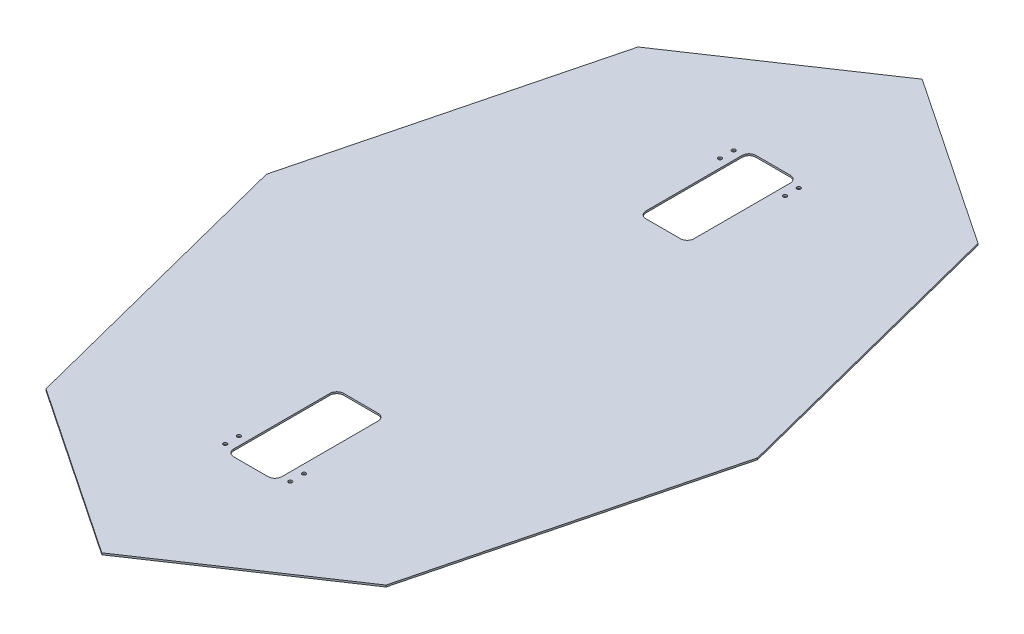
ISO-10303-21;
HEADER;
FILE_DESCRIPTION(('STEP AP214'),'2;1');
FILE_NAME('part.step','',(''),(''),'','','');
FILE_SCHEMA(('AUTOMOTIVE_DESIGN { 1 0 10303 214 1 1 1 1 }'));
ENDSEC;
DATA;
#1=APPLICATION_CONTEXT('core data for automotive mechanical design processes');
#2=APPLICATION_PROTOCOL_DEFINITION('international standard','automotive_design',2000,#1);
#3=PRODUCT_CONTEXT('',#1,'mechanical');
#4=PRODUCT('Part','Part','',(#3));
#5=PRODUCT_RELATED_PRODUCT_CATEGORY('part','',(#4));
#6=PRODUCT_DEFINITION_FORMATION('','',#4);
#7=PRODUCT_DEFINITION_CONTEXT('part definition',#1,'design');
#8=PRODUCT_DEFINITION('design','',#6,#7);
#9=PRODUCT_DEFINITION_SHAPE('','',#8);
#10=(LENGTH_UNIT() NAMED_UNIT(*) SI_UNIT(.MILLI.,.METRE.));
#11=(NAMED_UNIT(*) PLANE_ANGLE_UNIT() SI_UNIT($,.RADIAN.));
#12=(NAMED_UNIT(*) SI_UNIT($,.STERADIAN.) SOLID_ANGLE_UNIT());
#13=UNCERTAINTY_MEASURE_WITH_UNIT(LENGTH_MEASURE(1.E-05),#10,'distance_accuracy_value','');
#14=(GEOMETRIC_REPRESENTATION_CONTEXT(3) GLOBAL_UNCERTAINTY_ASSIGNED_CONTEXT((#13)) GLOBAL_UNIT_ASSIGNED_CONTEXT((#10,
#11,#12)) REPRESENTATION_CONTEXT('',''));
#15=CARTESIAN_POINT('',(0.,0.,0.));
#16=DIRECTION('',(0.,0.,1.));
#17=DIRECTION('',(1.,0.,0.));
#18=AXIS2_PLACEMENT_3D('',#15,#16,#17);
#19=CARTESIAN_POINT('',(0.,1.5875,0.));
#20=DIRECTION('',(0.,1.,0.));
#21=DIRECTION('',(0.,0.,1.));
#22=AXIS2_PLACEMENT_3D('',#19,#20,#21);
#23=PLANE('',#22);
#24=CARTESIAN_POINT('',(-60.1980000000001,1.5875,469.9));
#25=DIRECTION('',(0.,-1.,0.));
#26=DIRECTION('',(0.,0.,-1.));
#27=AXIS2_PLACEMENT_3D('',#24,#25,#26);
#28=CIRCLE('',#27,3.429);
#29=CARTESIAN_POINT('',(-60.1980000000001,1.5875,466.471));
#30=VERTEX_POINT('',#29);
#31=EDGE_CURVE('E617',#30,#30,#28,.T.);
#32=ORIENTED_EDGE('',*,*,#31,.T.);
#33=EDGE_LOOP('',(#32));
#34=FACE_BOUND('',#33,.T.);
#35=CARTESIAN_POINT('',(-60.1980000000001,1.5875,444.5));
#36=DIRECTION('',(0.,-1.,0.));
#37=DIRECTION('',(0.,0.,-1.));
#38=AXIS2_PLACEMENT_3D('',#35,#36,#37);
#39=CIRCLE('',#38,3.429);
#40=CARTESIAN_POINT('',(-60.1980000000001,1.5875,441.071));
#41=VERTEX_POINT('',#40);
#42=EDGE_CURVE('E611',#41,#41,#39,.T.);
#43=ORIENTED_EDGE('',*,*,#42,.T.);
#44=EDGE_LOOP('',(#43));
#45=FACE_BOUND('',#44,.T.);
#46=CARTESIAN_POINT('',(60.1979999999999,1.5875,444.5));
#47=DIRECTION('',(0.,1.,0.));
#48=DIRECTION('',(0.,0.,1.));
#49=AXIS2_PLACEMENT_3D('',#46,#47,#48);
#50=CIRCLE('',#49,3.42899999999999);
#51=CARTESIAN_POINT('',(60.1979999999999,1.5875,447.929));
#52=VERTEX_POINT('',#51);
#53=EDGE_CURVE('E614',#52,#52,#50,.T.);
#54=ORIENTED_EDGE('',*,*,#53,.F.);
#55=EDGE_LOOP('',(#54));
#56=FACE_BOUND('',#55,.T.);
#57=CARTESIAN_POINT('',(60.1979999999999,1.5875,469.9));
#58=DIRECTION('',(0.,1.,0.));
#59=DIRECTION('',(0.,0.,1.));
#60=AXIS2_PLACEMENT_3D('',#57,#58,#59);
#61=CIRCLE('',#60,3.42899999999999);
#62=CARTESIAN_POINT('',(60.1979999999999,1.5875,473.329));
#63=VERTEX_POINT('',#62);
#64=EDGE_CURVE('E626',#63,#63,#61,.T.);
#65=ORIENTED_EDGE('',*,*,#64,.F.);
#66=EDGE_LOOP('',(#65));
#67=FACE_BOUND('',#66,.T.);
#68=CARTESIAN_POINT('',(-60.1980000000001,1.5875,-469.9));
#69=DIRECTION('',(0.,1.,0.));
#70=DIRECTION('',(0.,0.,1.));
#71=AXIS2_PLACEMENT_3D('',#68,#69,#70);
#72=CIRCLE('',#71,3.429);
#73=CARTESIAN_POINT('',(-60.1980000000001,1.5875,-466.471));
#74=VERTEX_POINT('',#73);
#75=EDGE_CURVE('E405',#74,#74,#72,.T.);
#76=ORIENTED_EDGE('',*,*,#75,.F.);
#77=EDGE_LOOP('',(#76));
#78=FACE_BOUND('',#77,.T.);
#79=CARTESIAN_POINT('',(-60.1980000000001,1.5875,-444.5));
#80=DIRECTION('',(0.,1.,0.));
#81=DIRECTION('',(0.,0.,1.));
#82=AXIS2_PLACEMENT_3D('',#79,#80,#81);
#83=CIRCLE('',#82,3.429);
#84=CARTESIAN_POINT('',(-60.1980000000001,1.5875,-441.071));
#85=VERTEX_POINT('',#84);
#86=EDGE_CURVE('E411',#85,#85,#83,.T.);
#87=ORIENTED_EDGE('',*,*,#86,.F.);
#88=EDGE_LOOP('',(#87));
#89=FACE_BOUND('',#88,.T.);
#90=CARTESIAN_POINT('',(60.1979999999999,1.5875,-444.5));
#91=DIRECTION('',(0.,-1.,0.));
#92=DIRECTION('',(0.,0.,-1.));
#93=AXIS2_PLACEMENT_3D('',#90,#91,#92);
#94=CIRCLE('',#93,3.42899999999999);
#95=CARTESIAN_POINT('',(60.1979999999999,1.5875,-447.929));
#96=VERTEX_POINT('',#95);
#97=EDGE_CURVE('E417',#96,#96,#94,.T.);
#98=ORIENTED_EDGE('',*,*,#97,.T.);
#99=EDGE_LOOP('',(#98));
#100=FACE_BOUND('',#99,.T.);
#101=CARTESIAN_POINT('',(60.1979999999999,1.5875,-469.9));
#102=DIRECTION('',(0.,-1.,0.));
#103=DIRECTION('',(0.,0.,-1.));
#104=AXIS2_PLACEMENT_3D('',#101,#102,#103);
#105=CIRCLE('',#104,3.42899999999999);
#106=CARTESIAN_POINT('',(60.1979999999999,1.5875,-473.329));
#107=VERTEX_POINT('',#106);
#108=EDGE_CURVE('E423',#107,#107,#105,.T.);
#109=ORIENTED_EDGE('',*,*,#108,.T.);
#110=EDGE_LOOP('',(#109));
#111=FACE_BOUND('',#110,.T.);
#112=DIRECTION('',(1.,0.,0.));
#113=VECTOR('',#112,1.);
#114=CARTESIAN_POINT('',(-44.45,1.5875,-279.4));
#115=LINE('',#114,#113);
#116=CARTESIAN_POINT('',(-31.75,1.5875,-279.4));
#117=VERTEX_POINT('',#116);
#118=CARTESIAN_POINT('',(31.75,1.5875,-279.4));
#119=VERTEX_POINT('',#118);
#120=EDGE_CURVE('E426',#117,#119,#115,.T.);
#121=ORIENTED_EDGE('',*,*,#120,.F.);
#122=CARTESIAN_POINT('',(-31.75,1.5875,-292.1));
#123=DIRECTION('',(0.,1.,0.));
#124=DIRECTION('',(0.,0.,1.));
#125=AXIS2_PLACEMENT_3D('',#122,#123,#124);
#126=CIRCLE('',#125,12.7);
#127=CARTESIAN_POINT('',(-44.45,1.5875,-292.1));
#128=VERTEX_POINT('',#127);
#129=EDGE_CURVE('E245',#117,#128,#126,.F.);
#130=ORIENTED_EDGE('',*,*,#129,.T.);
#131=DIRECTION('',(0.,0.,-1.));
#132=VECTOR('',#131,1.);
#133=CARTESIAN_POINT('',(-44.45,1.5875,-279.4));
#134=LINE('',#133,#132);
#135=CARTESIAN_POINT('',(-44.45,1.5875,-469.9));
#136=VERTEX_POINT('',#135);
#137=EDGE_CURVE('E435',#128,#136,#134,.T.);
#138=ORIENTED_EDGE('',*,*,#137,.T.);
#139=CARTESIAN_POINT('',(-31.75,1.5875,-469.9));
#140=DIRECTION('',(0.,1.,0.));
#141=DIRECTION('',(0.,0.,1.));
#142=AXIS2_PLACEMENT_3D('',#139,#140,#141);
#143=CIRCLE('',#142,12.7);
#144=CARTESIAN_POINT('',(-31.75,1.5875,-482.6));
#145=VERTEX_POINT('',#144);
#146=EDGE_CURVE('E253',#136,#145,#143,.F.);
#147=ORIENTED_EDGE('',*,*,#146,.T.);
#148=DIRECTION('',(1.,0.,0.));
#149=VECTOR('',#148,1.);
#150=CARTESIAN_POINT('',(-44.45,1.5875,-482.6));
#151=LINE('',#150,#149);
#152=CARTESIAN_POINT('',(31.75,1.5875,-482.6));
#153=VERTEX_POINT('',#152);
#154=EDGE_CURVE('E432',#145,#153,#151,.T.);
#155=ORIENTED_EDGE('',*,*,#154,.T.);
#156=CARTESIAN_POINT('',(31.75,1.5875,-469.9));
#157=DIRECTION('',(0.,1.,0.));
#158=DIRECTION('',(0.,0.,1.));
#159=AXIS2_PLACEMENT_3D('',#156,#157,#158);
#160=CIRCLE('',#159,12.7);
#161=CARTESIAN_POINT('',(44.45,1.5875,-469.9));
#162=VERTEX_POINT('',#161);
#163=EDGE_CURVE('E257',#153,#162,#160,.F.);
#164=ORIENTED_EDGE('',*,*,#163,.T.);
#165=DIRECTION('',(0.,0.,-1.));
#166=VECTOR('',#165,1.);
#167=CARTESIAN_POINT('',(44.45,1.5875,-279.4));
#168=LINE('',#167,#166);
#169=CARTESIAN_POINT('',(44.45,1.5875,-292.1));
#170=VERTEX_POINT('',#169);
#171=EDGE_CURVE('E429',#170,#162,#168,.T.);
#172=ORIENTED_EDGE('',*,*,#171,.F.);
#173=CARTESIAN_POINT('',(31.75,1.5875,-292.1));
#174=DIRECTION('',(0.,1.,0.));
#175=DIRECTION('',(0.,0.,1.));
#176=AXIS2_PLACEMENT_3D('',#173,#174,#175);
#177=CIRCLE('',#176,12.7);
#178=EDGE_CURVE('E249',#170,#119,#177,.F.);
#179=ORIENTED_EDGE('',*,*,#178,.T.);
#180=EDGE_LOOP('',(#121,#130,#138,#147,#155,#164,#172,#179));
#181=FACE_BOUND('',#180,.T.);
#182=DIRECTION('',(-0.830136035999269,0.,0.557560904059297));
#183=VECTOR('',#182,1.);
#184=CARTESIAN_POINT('',(-314.234696616118,1.5875,-547.119578241946));
#185=LINE('',#184,#183);
#186=CARTESIAN_POINT('',(0.,1.5875,-758.175325654695));
#187=VERTEX_POINT('',#186);
#188=CARTESIAN_POINT('',(-314.234696616118,1.5875,-547.119578241946));
#189=VERTEX_POINT('',#188);
#190=EDGE_CURVE('E207',#187,#189,#185,.T.);
#191=ORIENTED_EDGE('',*,*,#190,.T.);
#192=DIRECTION('',(-0.247380499716694,0.,0.968918411611586));
#193=VECTOR('',#192,1.);
#194=CARTESIAN_POINT('',(-314.234696616118,1.5875,-547.119578241946));
#195=LINE('',#194,#193);
#196=CARTESIAN_POINT('',(-453.92315030662,1.5875,0.));
#197=VERTEX_POINT('',#196);
#198=EDGE_CURVE('E196',#189,#197,#195,.T.);
#199=ORIENTED_EDGE('',*,*,#198,.T.);
#200=DIRECTION('',(0.247380499716694,0.,0.968918411611586));
#201=VECTOR('',#200,1.);
#202=CARTESIAN_POINT('',(-314.234696616118,1.5875,547.119578241946));
#203=LINE('',#202,#201);
#204=CARTESIAN_POINT('',(-314.234696616118,1.5875,547.119578241946));
#205=VERTEX_POINT('',#204);
#206=EDGE_CURVE('E206',#197,#205,#203,.T.);
#207=ORIENTED_EDGE('',*,*,#206,.T.);
#208=DIRECTION('',(0.830136035999269,0.,0.557560904059297));
#209=VECTOR('',#208,1.);
#210=CARTESIAN_POINT('',(1.11022302462516E-13,1.5875,758.175325654695));
#211=LINE('',#210,#209);
#212=CARTESIAN_POINT('',(1.11022302462516E-13,1.5875,758.175325654695));
#213=VERTEX_POINT('',#212);
#214=EDGE_CURVE('E451',#205,#213,#211,.T.);
#215=ORIENTED_EDGE('',*,*,#214,.T.);
#216=DIRECTION('',(0.830136035999269,0.,-0.557560904059297));
#217=VECTOR('',#216,1.);
#218=CARTESIAN_POINT('',(314.234696616118,1.5875,547.119578241947));
#219=LINE('',#218,#217);
#220=CARTESIAN_POINT('',(314.234696616118,1.5875,547.119578241947));
#221=VERTEX_POINT('',#220);
#222=EDGE_CURVE('E453',#213,#221,#219,.T.);
#223=ORIENTED_EDGE('',*,*,#222,.T.);
#224=DIRECTION('',(0.247380499716694,0.,-0.968918411611586));
#225=VECTOR('',#224,1.);
#226=CARTESIAN_POINT('',(314.234696616118,1.5875,547.119578241947));
#227=LINE('',#226,#225);
#228=CARTESIAN_POINT('',(453.92315030662,1.5875,0.));
#229=VERTEX_POINT('',#228);
#230=EDGE_CURVE('E455',#221,#229,#227,.T.);
#231=ORIENTED_EDGE('',*,*,#230,.T.);
#232=DIRECTION('',(-0.247380499716694,0.,-0.968918411611586));
#233=VECTOR('',#232,1.);
#234=CARTESIAN_POINT('',(453.92315030662,1.5875,0.));
#235=LINE('',#234,#233);
#236=CARTESIAN_POINT('',(314.234696616118,1.5875,-547.119578241946));
#237=VERTEX_POINT('',#236);
#238=EDGE_CURVE('E457',#229,#237,#235,.T.);
#239=ORIENTED_EDGE('',*,*,#238,.T.);
#240=DIRECTION('',(-0.830136035999269,0.,-0.557560904059297));
#241=VECTOR('',#240,1.);
#242=CARTESIAN_POINT('',(314.234696616118,1.5875,-547.119578241946));
#243=LINE('',#242,#241);
#244=EDGE_CURVE('E211',#237,#187,#243,.T.);
#245=ORIENTED_EDGE('',*,*,#244,.T.);
#246=EDGE_LOOP('',(#191,#199,#207,#215,#223,#231,#239,#245));
#247=FACE_BOUND('',#246,.T.);
#248=DIRECTION('',(0.,0.,1.));
#249=VECTOR('',#248,1.);
#250=CARTESIAN_POINT('',(-44.45,1.5875,279.4));
#251=LINE('',#250,#249);
#252=CARTESIAN_POINT('',(-44.45,1.5875,292.1));
#253=VERTEX_POINT('',#252);
#254=CARTESIAN_POINT('',(-44.45,1.5875,469.9));
#255=VERTEX_POINT('',#254);
#256=EDGE_CURVE('E635',#253,#255,#251,.T.);
#257=ORIENTED_EDGE('',*,*,#256,.F.);
#258=CARTESIAN_POINT('',(-31.75,1.5875,292.1));
#259=DIRECTION('',(0.,1.,0.));
#260=DIRECTION('',(0.,0.,1.));
#261=AXIS2_PLACEMENT_3D('',#258,#259,#260);
#262=CIRCLE('',#261,12.7);
#263=CARTESIAN_POINT('',(-31.75,1.5875,279.4));
#264=VERTEX_POINT('',#263);
#265=EDGE_CURVE('E280',#253,#264,#262,.F.);
#266=ORIENTED_EDGE('',*,*,#265,.T.);
#267=DIRECTION('',(1.,0.,0.));
#268=VECTOR('',#267,1.);
#269=CARTESIAN_POINT('',(-44.45,1.5875,279.4));
#270=LINE('',#269,#268);
#271=CARTESIAN_POINT('',(31.75,1.5875,279.4));
#272=VERTEX_POINT('',#271);
#273=EDGE_CURVE('E632',#264,#272,#270,.T.);
#274=ORIENTED_EDGE('',*,*,#273,.T.);
#275=CARTESIAN_POINT('',(31.75,1.5875,292.1));
#276=DIRECTION('',(0.,1.,0.));
#277=DIRECTION('',(0.,0.,1.));
#278=AXIS2_PLACEMENT_3D('',#275,#276,#277);
#279=CIRCLE('',#278,12.7);
#280=CARTESIAN_POINT('',(44.45,1.5875,292.1));
#281=VERTEX_POINT('',#280);
#282=EDGE_CURVE('E284',#272,#281,#279,.F.);
#283=ORIENTED_EDGE('',*,*,#282,.T.);
#284=DIRECTION('',(0.,0.,1.));
#285=VECTOR('',#284,1.);
#286=CARTESIAN_POINT('',(44.45,1.5875,279.4));
#287=LINE('',#286,#285);
#288=CARTESIAN_POINT('',(44.45,1.5875,469.9));
#289=VERTEX_POINT('',#288);
#290=EDGE_CURVE('E396',#281,#289,#287,.T.);
#291=ORIENTED_EDGE('',*,*,#290,.T.);
#292=CARTESIAN_POINT('',(31.75,1.5875,469.9));
#293=DIRECTION('',(0.,1.,0.));
#294=DIRECTION('',(0.,0.,1.));
#295=AXIS2_PLACEMENT_3D('',#292,#293,#294);
#296=CIRCLE('',#295,12.7);
#297=CARTESIAN_POINT('',(31.75,1.5875,482.6));
#298=VERTEX_POINT('',#297);
#299=EDGE_CURVE('E43',#289,#298,#296,.F.);
#300=ORIENTED_EDGE('',*,*,#299,.T.);
#301=DIRECTION('',(1.,0.,0.));
#302=VECTOR('',#301,1.);
#303=CARTESIAN_POINT('',(-44.45,1.5875,482.6));
#304=LINE('',#303,#302);
#305=CARTESIAN_POINT('',(-31.75,1.5875,482.6));
#306=VERTEX_POINT('',#305);
#307=EDGE_CURVE('E637',#306,#298,#304,.T.);
#308=ORIENTED_EDGE('',*,*,#307,.F.);
#309=CARTESIAN_POINT('',(-31.75,1.5875,469.9));
#310=DIRECTION('',(0.,1.,0.));
#311=DIRECTION('',(0.,0.,1.));
#312=AXIS2_PLACEMENT_3D('',#309,#310,#311);
#313=CIRCLE('',#312,12.7);
#314=EDGE_CURVE('E57',#306,#255,#313,.F.);
#315=ORIENTED_EDGE('',*,*,#314,.T.);
#316=EDGE_LOOP('',(#257,#266,#274,#283,#291,#300,#308,#315));
#317=FACE_BOUND('',#316,.T.);
#318=ADVANCED_FACE('F35',(#34,#45,#56,#67,#78,#89,#100,#111,#181,#247,#317),#23,.T.);
#319=CARTESIAN_POINT('',(0.,-1.5875,0.));
#320=DIRECTION('',(0.,1.,0.));
#321=DIRECTION('',(0.,0.,1.));
#322=AXIS2_PLACEMENT_3D('',#319,#320,#321);
#323=PLANE('',#322);
#324=CARTESIAN_POINT('',(-60.1980000000001,-1.5875,469.9));
#325=DIRECTION('',(0.,-1.,0.));
#326=DIRECTION('',(0.,0.,-1.));
#327=AXIS2_PLACEMENT_3D('',#324,#325,#326);
#328=CIRCLE('',#327,3.429);
#329=CARTESIAN_POINT('',(-60.1980000000001,-1.5875,466.471));
#330=VERTEX_POINT('',#329);
#331=EDGE_CURVE('E612',#330,#330,#328,.T.);
#332=ORIENTED_EDGE('',*,*,#331,.F.);
#333=EDGE_LOOP('',(#332));
#334=FACE_BOUND('',#333,.T.);
#335=CARTESIAN_POINT('',(-60.1980000000001,-1.5875,444.5));
#336=DIRECTION('',(0.,-1.,0.));
#337=DIRECTION('',(0.,0.,-1.));
#338=AXIS2_PLACEMENT_3D('',#335,#336,#337);
#339=CIRCLE('',#338,3.429);
#340=CARTESIAN_POINT('',(-60.1980000000001,-1.5875,441.071));
#341=VERTEX_POINT('',#340);
#342=EDGE_CURVE('E608',#341,#341,#339,.T.);
#343=ORIENTED_EDGE('',*,*,#342,.F.);
#344=EDGE_LOOP('',(#343));
#345=FACE_BOUND('',#344,.T.);
#346=CARTESIAN_POINT('',(60.1979999999999,-1.5875,444.5));
#347=DIRECTION('',(0.,1.,0.));
#348=DIRECTION('',(0.,0.,1.));
#349=AXIS2_PLACEMENT_3D('',#346,#347,#348);
#350=CIRCLE('',#349,3.42899999999999);
#351=CARTESIAN_POINT('',(60.1979999999999,-1.5875,447.929));
#352=VERTEX_POINT('',#351);
#353=EDGE_CURVE('E623',#352,#352,#350,.T.);
#354=ORIENTED_EDGE('',*,*,#353,.T.);
#355=EDGE_LOOP('',(#354));
#356=FACE_BOUND('',#355,.T.);
#357=CARTESIAN_POINT('',(60.1979999999999,-1.5875,469.9));
#358=DIRECTION('',(0.,1.,0.));
#359=DIRECTION('',(0.,0.,1.));
#360=AXIS2_PLACEMENT_3D('',#357,#358,#359);
#361=CIRCLE('',#360,3.42899999999999);
#362=CARTESIAN_POINT('',(60.1979999999999,-1.5875,473.329));
#363=VERTEX_POINT('',#362);
#364=EDGE_CURVE('E629',#363,#363,#361,.T.);
#365=ORIENTED_EDGE('',*,*,#364,.T.);
#366=EDGE_LOOP('',(#365));
#367=FACE_BOUND('',#366,.T.);
#368=DIRECTION('',(-0.830136035999269,0.,0.557560904059297));
#369=VECTOR('',#368,1.);
#370=CARTESIAN_POINT('',(-314.234696616118,-1.5875,-547.119578241946));
#371=LINE('',#370,#369);
#372=CARTESIAN_POINT('',(0.,-1.5875,-758.175325654695));
#373=VERTEX_POINT('',#372);
#374=CARTESIAN_POINT('',(-314.234696616118,-1.5875,-547.119578241946));
#375=VERTEX_POINT('',#374);
#376=EDGE_CURVE('E219',#373,#375,#371,.T.);
#377=ORIENTED_EDGE('',*,*,#376,.F.);
#378=DIRECTION('',(-0.830136035999269,0.,-0.557560904059297));
#379=VECTOR('',#378,1.);
#380=CARTESIAN_POINT('',(314.234696616118,-1.5875,-547.119578241946));
#381=LINE('',#380,#379);
#382=CARTESIAN_POINT('',(314.234696616118,-1.5875,-547.119578241946));
#383=VERTEX_POINT('',#382);
#384=EDGE_CURVE('E215',#383,#373,#381,.T.);
#385=ORIENTED_EDGE('',*,*,#384,.F.);
#386=DIRECTION('',(-0.247380499716694,0.,-0.968918411611586));
#387=VECTOR('',#386,1.);
#388=CARTESIAN_POINT('',(453.92315030662,-1.5875,0.));
#389=LINE('',#388,#387);
#390=CARTESIAN_POINT('',(453.92315030662,-1.5875,0.));
#391=VERTEX_POINT('',#390);
#392=EDGE_CURVE('E472',#391,#383,#389,.T.);
#393=ORIENTED_EDGE('',*,*,#392,.F.);
#394=DIRECTION('',(0.247380499716694,0.,-0.968918411611586));
#395=VECTOR('',#394,1.);
#396=CARTESIAN_POINT('',(314.234696616118,-1.5875,547.119578241947));
#397=LINE('',#396,#395);
#398=CARTESIAN_POINT('',(314.234696616118,-1.5875,547.119578241947));
#399=VERTEX_POINT('',#398);
#400=EDGE_CURVE('E470',#399,#391,#397,.T.);
#401=ORIENTED_EDGE('',*,*,#400,.F.);
#402=DIRECTION('',(0.830136035999269,0.,-0.557560904059297));
#403=VECTOR('',#402,1.);
#404=CARTESIAN_POINT('',(314.234696616118,-1.5875,547.119578241947));
#405=LINE('',#404,#403);
#406=CARTESIAN_POINT('',(1.11022302462516E-13,-1.5875,758.175325654695));
#407=VERTEX_POINT('',#406);
#408=EDGE_CURVE('E468',#407,#399,#405,.T.);
#409=ORIENTED_EDGE('',*,*,#408,.F.);
#410=DIRECTION('',(0.830136035999269,0.,0.557560904059297));
#411=VECTOR('',#410,1.);
#412=CARTESIAN_POINT('',(1.11022302462516E-13,-1.5875,758.175325654695));
#413=LINE('',#412,#411);
#414=CARTESIAN_POINT('',(-314.234696616118,-1.5875,547.119578241946));
#415=VERTEX_POINT('',#414);
#416=EDGE_CURVE('E466',#415,#407,#413,.T.);
#417=ORIENTED_EDGE('',*,*,#416,.F.);
#418=DIRECTION('',(0.247380499716694,0.,0.968918411611586));
#419=VECTOR('',#418,1.);
#420=CARTESIAN_POINT('',(-314.234696616118,-1.5875,547.119578241946));
#421=LINE('',#420,#419);
#422=CARTESIAN_POINT('',(-453.92315030662,-1.5875,0.));
#423=VERTEX_POINT('',#422);
#424=EDGE_CURVE('E464',#423,#415,#421,.T.);
#425=ORIENTED_EDGE('',*,*,#424,.F.);
#426=DIRECTION('',(-0.247380499716694,0.,0.968918411611586));
#427=VECTOR('',#426,1.);
#428=CARTESIAN_POINT('',(-314.234696616118,-1.5875,-547.119578241946));
#429=LINE('',#428,#427);
#430=EDGE_CURVE('E462',#375,#423,#429,.T.);
#431=ORIENTED_EDGE('',*,*,#430,.F.);
#432=EDGE_LOOP('',(#377,#385,#393,#401,#409,#417,#425,#431));
#433=FACE_BOUND('',#432,.T.);
#434=DIRECTION('',(0.,0.,-1.));
#435=VECTOR('',#434,1.);
#436=CARTESIAN_POINT('',(-44.45,-1.5875,-279.4));
#437=LINE('',#436,#435);
#438=CARTESIAN_POINT('',(-44.45,-1.5875,-292.1));
#439=VERTEX_POINT('',#438);
#440=CARTESIAN_POINT('',(-44.45,-1.5875,-469.9));
#441=VERTEX_POINT('',#440);
#442=EDGE_CURVE('E447',#439,#441,#437,.T.);
#443=ORIENTED_EDGE('',*,*,#442,.F.);
#444=CARTESIAN_POINT('',(-31.75,-1.5875,-292.1));
#445=DIRECTION('',(0.,1.,0.));
#446=DIRECTION('',(0.,0.,1.));
#447=AXIS2_PLACEMENT_3D('',#444,#445,#446);
#448=CIRCLE('',#447,12.7);
#449=CARTESIAN_POINT('',(-31.75,-1.5875,-279.4));
#450=VERTEX_POINT('',#449);
#451=EDGE_CURVE('E247',#439,#450,#448,.T.);
#452=ORIENTED_EDGE('',*,*,#451,.T.);
#453=DIRECTION('',(1.,0.,0.));
#454=VECTOR('',#453,1.);
#455=CARTESIAN_POINT('',(-44.45,-1.5875,-279.4));
#456=LINE('',#455,#454);
#457=CARTESIAN_POINT('',(31.75,-1.5875,-279.4));
#458=VERTEX_POINT('',#457);
#459=EDGE_CURVE('E438',#450,#458,#456,.T.);
#460=ORIENTED_EDGE('',*,*,#459,.T.);
#461=CARTESIAN_POINT('',(31.75,-1.5875,-292.1));
#462=DIRECTION('',(0.,1.,0.));
#463=DIRECTION('',(0.,0.,1.));
#464=AXIS2_PLACEMENT_3D('',#461,#462,#463);
#465=CIRCLE('',#464,12.7);
#466=CARTESIAN_POINT('',(44.45,-1.5875,-292.1));
#467=VERTEX_POINT('',#466);
#468=EDGE_CURVE('E251',#458,#467,#465,.T.);
#469=ORIENTED_EDGE('',*,*,#468,.T.);
#470=DIRECTION('',(0.,0.,-1.));
#471=VECTOR('',#470,1.);
#472=CARTESIAN_POINT('',(44.45,-1.5875,-279.4));
#473=LINE('',#472,#471);
#474=CARTESIAN_POINT('',(44.45,-1.5875,-469.9));
#475=VERTEX_POINT('',#474);
#476=EDGE_CURVE('E441',#467,#475,#473,.T.);
#477=ORIENTED_EDGE('',*,*,#476,.T.);
#478=CARTESIAN_POINT('',(31.75,-1.5875,-469.9));
#479=DIRECTION('',(0.,1.,0.));
#480=DIRECTION('',(0.,0.,1.));
#481=AXIS2_PLACEMENT_3D('',#478,#479,#480);
#482=CIRCLE('',#481,12.7);
#483=CARTESIAN_POINT('',(31.75,-1.5875,-482.6));
#484=VERTEX_POINT('',#483);
#485=EDGE_CURVE('E259',#475,#484,#482,.T.);
#486=ORIENTED_EDGE('',*,*,#485,.T.);
#487=DIRECTION('',(1.,0.,0.));
#488=VECTOR('',#487,1.);
#489=CARTESIAN_POINT('',(-44.45,-1.5875,-482.6));
#490=LINE('',#489,#488);
#491=CARTESIAN_POINT('',(-31.75,-1.5875,-482.6));
#492=VERTEX_POINT('',#491);
#493=EDGE_CURVE('E444',#492,#484,#490,.T.);
#494=ORIENTED_EDGE('',*,*,#493,.F.);
#495=CARTESIAN_POINT('',(-31.75,-1.5875,-469.9));
#496=DIRECTION('',(0.,1.,0.));
#497=DIRECTION('',(0.,0.,1.));
#498=AXIS2_PLACEMENT_3D('',#495,#496,#497);
#499=CIRCLE('',#498,12.7);
#500=EDGE_CURVE('E255',#492,#441,#499,.T.);
#501=ORIENTED_EDGE('',*,*,#500,.T.);
#502=EDGE_LOOP('',(#443,#452,#460,#469,#477,#486,#494,#501));
#503=FACE_BOUND('',#502,.T.);
#504=CARTESIAN_POINT('',(60.1979999999999,-1.5875,-469.9));
#505=DIRECTION('',(0.,-1.,0.));
#506=DIRECTION('',(0.,0.,-1.));
#507=AXIS2_PLACEMENT_3D('',#504,#505,#506);
#508=CIRCLE('',#507,3.42899999999999);
#509=CARTESIAN_POINT('',(60.1979999999999,-1.5875,-473.329));
#510=VERTEX_POINT('',#509);
#511=EDGE_CURVE('E420',#510,#510,#508,.T.);
#512=ORIENTED_EDGE('',*,*,#511,.F.);
#513=EDGE_LOOP('',(#512));
#514=FACE_BOUND('',#513,.T.);
#515=CARTESIAN_POINT('',(60.1979999999999,-1.5875,-444.5));
#516=DIRECTION('',(0.,-1.,0.));
#517=DIRECTION('',(0.,0.,-1.));
#518=AXIS2_PLACEMENT_3D('',#515,#516,#517);
#519=CIRCLE('',#518,3.42899999999999);
#520=CARTESIAN_POINT('',(60.1979999999999,-1.5875,-447.929));
#521=VERTEX_POINT('',#520);
#522=EDGE_CURVE('E414',#521,#521,#519,.T.);
#523=ORIENTED_EDGE('',*,*,#522,.F.);
#524=EDGE_LOOP('',(#523));
#525=FACE_BOUND('',#524,.T.);
#526=CARTESIAN_POINT('',(-60.1980000000001,-1.5875,-444.5));
#527=DIRECTION('',(0.,1.,0.));
#528=DIRECTION('',(0.,0.,1.));
#529=AXIS2_PLACEMENT_3D('',#526,#527,#528);
#530=CIRCLE('',#529,3.429);
#531=CARTESIAN_POINT('',(-60.1980000000001,-1.5875,-441.071));
#532=VERTEX_POINT('',#531);
#533=EDGE_CURVE('E408',#532,#532,#530,.T.);
#534=ORIENTED_EDGE('',*,*,#533,.T.);
#535=EDGE_LOOP('',(#534));
#536=FACE_BOUND('',#535,.T.);
#537=CARTESIAN_POINT('',(-60.1980000000001,-1.5875,-469.9));
#538=DIRECTION('',(0.,1.,0.));
#539=DIRECTION('',(0.,0.,1.));
#540=AXIS2_PLACEMENT_3D('',#537,#538,#539);
#541=CIRCLE('',#540,3.429);
#542=CARTESIAN_POINT('',(-60.1980000000001,-1.5875,-466.471));
#543=VERTEX_POINT('',#542);
#544=EDGE_CURVE('E402',#543,#543,#541,.T.);
#545=ORIENTED_EDGE('',*,*,#544,.T.);
#546=EDGE_LOOP('',(#545));
#547=FACE_BOUND('',#546,.T.);
#548=DIRECTION('',(1.,0.,0.));
#549=VECTOR('',#548,1.);
#550=CARTESIAN_POINT('',(-44.45,-1.5875,279.4));
#551=LINE('',#550,#549);
#552=CARTESIAN_POINT('',(-31.75,-1.5875,279.4));
#553=VERTEX_POINT('',#552);
#554=CARTESIAN_POINT('',(31.75,-1.5875,279.4));
#555=VERTEX_POINT('',#554);
#556=EDGE_CURVE('E390',#553,#555,#551,.T.);
#557=ORIENTED_EDGE('',*,*,#556,.F.);
#558=CARTESIAN_POINT('',(-31.75,-1.5875,292.1));
#559=DIRECTION('',(0.,1.,0.));
#560=DIRECTION('',(0.,0.,1.));
#561=AXIS2_PLACEMENT_3D('',#558,#559,#560);
#562=CIRCLE('',#561,12.7);
#563=CARTESIAN_POINT('',(-44.45,-1.5875,292.1));
#564=VERTEX_POINT('',#563);
#565=EDGE_CURVE('E282',#553,#564,#562,.T.);
#566=ORIENTED_EDGE('',*,*,#565,.T.);
#567=DIRECTION('',(0.,0.,1.));
#568=VECTOR('',#567,1.);
#569=CARTESIAN_POINT('',(-44.45,-1.5875,279.4));
#570=LINE('',#569,#568);
#571=CARTESIAN_POINT('',(-44.45,-1.5875,469.9));
#572=VERTEX_POINT('',#571);
#573=EDGE_CURVE('E300',#564,#572,#570,.T.);
#574=ORIENTED_EDGE('',*,*,#573,.T.);
#575=CARTESIAN_POINT('',(-31.75,-1.5875,469.9));
#576=DIRECTION('',(0.,1.,0.));
#577=DIRECTION('',(0.,0.,1.));
#578=AXIS2_PLACEMENT_3D('',#575,#576,#577);
#579=CIRCLE('',#578,12.7);
#580=CARTESIAN_POINT('',(-31.75,-1.5875,482.6));
#581=VERTEX_POINT('',#580);
#582=EDGE_CURVE('E289',#572,#581,#579,.T.);
#583=ORIENTED_EDGE('',*,*,#582,.T.);
#584=DIRECTION('',(1.,0.,0.));
#585=VECTOR('',#584,1.);
#586=CARTESIAN_POINT('',(-44.45,-1.5875,482.6));
#587=LINE('',#586,#585);
#588=CARTESIAN_POINT('',(31.75,-1.5875,482.6));
#589=VERTEX_POINT('',#588);
#590=EDGE_CURVE('E297',#581,#589,#587,.T.);
#591=ORIENTED_EDGE('',*,*,#590,.T.);
#592=CARTESIAN_POINT('',(31.75,-1.5875,469.9));
#593=DIRECTION('',(0.,1.,0.));
#594=DIRECTION('',(0.,0.,1.));
#595=AXIS2_PLACEMENT_3D('',#592,#593,#594);
#596=CIRCLE('',#595,12.7);
#597=CARTESIAN_POINT('',(44.45,-1.5875,469.9));
#598=VERTEX_POINT('',#597);
#599=EDGE_CURVE('E11',#589,#598,#596,.T.);
#600=ORIENTED_EDGE('',*,*,#599,.T.);
#601=DIRECTION('',(0.,0.,1.));
#602=VECTOR('',#601,1.);
#603=CARTESIAN_POINT('',(44.45,-1.5875,279.4));
#604=LINE('',#603,#602);
#605=CARTESIAN_POINT('',(44.45,-1.5875,292.1));
#606=VERTEX_POINT('',#605);
#607=EDGE_CURVE('E304',#606,#598,#604,.T.);
#608=ORIENTED_EDGE('',*,*,#607,.F.);
#609=CARTESIAN_POINT('',(31.75,-1.5875,292.1));
#610=DIRECTION('',(0.,1.,0.));
#611=DIRECTION('',(0.,0.,1.));
#612=AXIS2_PLACEMENT_3D('',#609,#610,#611);
#613=CIRCLE('',#612,12.7);
#614=EDGE_CURVE('E286',#606,#555,#613,.T.);
#615=ORIENTED_EDGE('',*,*,#614,.T.);
#616=EDGE_LOOP('',(#557,#566,#574,#583,#591,#600,#608,#615));
#617=FACE_BOUND('',#616,.T.);
#618=ADVANCED_FACE('F296',(#334,#345,#356,#367,#433,#503,#514,#525,#536,#547,#617),#323,.F.);
#619=CARTESIAN_POINT('',(-314.234696616118,1.5875,-547.119578241946));
#620=DIRECTION('',(0.557560904059297,0.,0.830136035999269));
#621=DIRECTION('',(0.830136035999269,0.,-0.557560904059297));
#622=AXIS2_PLACEMENT_3D('',#619,#620,#621);
#623=PLANE('',#622);
#624=ORIENTED_EDGE('',*,*,#376,.T.);
#625=DIRECTION('',(0.,-1.,0.));
#626=VECTOR('',#625,1.);
#627=CARTESIAN_POINT('',(-314.234696616118,1.5875,-547.119578241946));
#628=LINE('',#627,#626);
#629=EDGE_CURVE('E200',#189,#375,#628,.T.);
#630=ORIENTED_EDGE('',*,*,#629,.F.);
#631=ORIENTED_EDGE('',*,*,#190,.F.);
#632=DIRECTION('',(0.,-1.,0.));
#633=VECTOR('',#632,1.);
#634=CARTESIAN_POINT('',(0.,1.5875,-758.175325654695));
#635=LINE('',#634,#633);
#636=EDGE_CURVE('E460',#187,#373,#635,.T.);
#637=ORIENTED_EDGE('',*,*,#636,.T.);
#638=EDGE_LOOP('',(#624,#630,#631,#637));
#639=FACE_BOUND('',#638,.T.);
#640=ADVANCED_FACE('F217',(#639),#623,.F.);
#641=CARTESIAN_POINT('',(-314.234696616118,1.5875,-547.119578241946));
#642=DIRECTION('',(0.968918411611586,0.,0.247380499716694));
#643=DIRECTION('',(0.247380499716694,0.,-0.968918411611586));
#644=AXIS2_PLACEMENT_3D('',#641,#642,#643);
#645=PLANE('',#644);
#646=ORIENTED_EDGE('',*,*,#430,.T.);
#647=DIRECTION('',(0.,-1.,0.));
#648=VECTOR('',#647,1.);
#649=CARTESIAN_POINT('',(-453.92315030662,1.5875,0.));
#650=LINE('',#649,#648);
#651=EDGE_CURVE('E203',#197,#423,#650,.T.);
#652=ORIENTED_EDGE('',*,*,#651,.F.);
#653=ORIENTED_EDGE('',*,*,#198,.F.);
#654=ORIENTED_EDGE('',*,*,#629,.T.);
#655=EDGE_LOOP('',(#646,#652,#653,#654));
#656=FACE_BOUND('',#655,.T.);
#657=ADVANCED_FACE('F198',(#656),#645,.F.);
#658=CARTESIAN_POINT('',(-314.234696616118,1.5875,547.119578241946));
#659=DIRECTION('',(0.968918411611586,0.,-0.247380499716694));
#660=DIRECTION('',(-0.247380499716694,0.,-0.968918411611586));
#661=AXIS2_PLACEMENT_3D('',#658,#659,#660);
#662=PLANE('',#661);
#663=ORIENTED_EDGE('',*,*,#424,.T.);
#664=DIRECTION('',(0.,-1.,0.));
#665=VECTOR('',#664,1.);
#666=CARTESIAN_POINT('',(-314.234696616118,1.5875,547.119578241946));
#667=LINE('',#666,#665);
#668=EDGE_CURVE('E224',#205,#415,#667,.T.);
#669=ORIENTED_EDGE('',*,*,#668,.F.);
#670=ORIENTED_EDGE('',*,*,#206,.F.);
#671=ORIENTED_EDGE('',*,*,#651,.T.);
#672=EDGE_LOOP('',(#663,#669,#670,#671));
#673=FACE_BOUND('',#672,.T.);
#674=ADVANCED_FACE('F350',(#673),#662,.F.);
#675=CARTESIAN_POINT('',(1.11022302462516E-13,1.5875,758.175325654695));
#676=DIRECTION('',(0.557560904059297,0.,-0.830136035999269));
#677=DIRECTION('',(-0.830136035999269,0.,-0.557560904059297));
#678=AXIS2_PLACEMENT_3D('',#675,#676,#677);
#679=PLANE('',#678);
#680=ORIENTED_EDGE('',*,*,#416,.T.);
#681=DIRECTION('',(0.,-1.,0.));
#682=VECTOR('',#681,1.);
#683=CARTESIAN_POINT('',(1.11022302462516E-13,1.5875,758.175325654695));
#684=LINE('',#683,#682);
#685=EDGE_CURVE('E485',#213,#407,#684,.T.);
#686=ORIENTED_EDGE('',*,*,#685,.F.);
#687=ORIENTED_EDGE('',*,*,#214,.F.);
#688=ORIENTED_EDGE('',*,*,#668,.T.);
#689=EDGE_LOOP('',(#680,#686,#687,#688));
#690=FACE_BOUND('',#689,.T.);
#691=ADVANCED_FACE('F346',(#690),#679,.F.);
#692=CARTESIAN_POINT('',(314.234696616118,1.5875,547.119578241947));
#693=DIRECTION('',(-0.557560904059297,0.,-0.830136035999269));
#694=DIRECTION('',(-0.830136035999269,0.,0.557560904059297));
#695=AXIS2_PLACEMENT_3D('',#692,#693,#694);
#696=PLANE('',#695);
#697=ORIENTED_EDGE('',*,*,#408,.T.);
#698=DIRECTION('',(0.,-1.,0.));
#699=VECTOR('',#698,1.);
#700=CARTESIAN_POINT('',(314.234696616118,1.5875,547.119578241947));
#701=LINE('',#700,#699);
#702=EDGE_CURVE('E482',#221,#399,#701,.T.);
#703=ORIENTED_EDGE('',*,*,#702,.F.);
#704=ORIENTED_EDGE('',*,*,#222,.F.);
#705=ORIENTED_EDGE('',*,*,#685,.T.);
#706=EDGE_LOOP('',(#697,#703,#704,#705));
#707=FACE_BOUND('',#706,.T.);
#708=ADVANCED_FACE('F342',(#707),#696,.F.);
#709=CARTESIAN_POINT('',(314.234696616118,1.5875,547.119578241947));
#710=DIRECTION('',(-0.968918411611586,0.,-0.247380499716694));
#711=DIRECTION('',(-0.247380499716694,0.,0.968918411611586));
#712=AXIS2_PLACEMENT_3D('',#709,#710,#711);
#713=PLANE('',#712);
#714=ORIENTED_EDGE('',*,*,#400,.T.);
#715=DIRECTION('',(0.,-1.,0.));
#716=VECTOR('',#715,1.);
#717=CARTESIAN_POINT('',(453.92315030662,1.5875,0.));
#718=LINE('',#717,#716);
#719=EDGE_CURVE('E479',#229,#391,#718,.T.);
#720=ORIENTED_EDGE('',*,*,#719,.F.);
#721=ORIENTED_EDGE('',*,*,#230,.F.);
#722=ORIENTED_EDGE('',*,*,#702,.T.);
#723=EDGE_LOOP('',(#714,#720,#721,#722));
#724=FACE_BOUND('',#723,.T.);
#725=ADVANCED_FACE('F338',(#724),#713,.F.);
#726=CARTESIAN_POINT('',(453.92315030662,1.5875,0.));
#727=DIRECTION('',(-0.968918411611586,0.,0.247380499716694));
#728=DIRECTION('',(0.247380499716694,0.,0.968918411611586));
#729=AXIS2_PLACEMENT_3D('',#726,#727,#728);
#730=PLANE('',#729);
#731=ORIENTED_EDGE('',*,*,#392,.T.);
#732=DIRECTION('',(0.,-1.,0.));
#733=VECTOR('',#732,1.);
#734=CARTESIAN_POINT('',(314.234696616118,1.5875,-547.119578241946));
#735=LINE('',#734,#733);
#736=EDGE_CURVE('E476',#237,#383,#735,.T.);
#737=ORIENTED_EDGE('',*,*,#736,.F.);
#738=ORIENTED_EDGE('',*,*,#238,.F.);
#739=ORIENTED_EDGE('',*,*,#719,.T.);
#740=EDGE_LOOP('',(#731,#737,#738,#739));
#741=FACE_BOUND('',#740,.T.);
#742=ADVANCED_FACE('F334',(#741),#730,.F.);
#743=CARTESIAN_POINT('',(314.234696616118,1.5875,-547.119578241946));
#744=DIRECTION('',(-0.557560904059297,0.,0.830136035999269));
#745=DIRECTION('',(0.830136035999269,0.,0.557560904059297));
#746=AXIS2_PLACEMENT_3D('',#743,#744,#745);
#747=PLANE('',#746);
#748=ORIENTED_EDGE('',*,*,#384,.T.);
#749=ORIENTED_EDGE('',*,*,#636,.F.);
#750=ORIENTED_EDGE('',*,*,#244,.F.);
#751=ORIENTED_EDGE('',*,*,#736,.T.);
#752=EDGE_LOOP('',(#748,#749,#750,#751));
#753=FACE_BOUND('',#752,.T.);
#754=ADVANCED_FACE('F331',(#753),#747,.F.);
#755=CARTESIAN_POINT('',(-44.45,-1.5875,-279.4));
#756=DIRECTION('',(0.,0.,1.));
#757=DIRECTION('',(1.,0.,0.));
#758=AXIS2_PLACEMENT_3D('',#755,#756,#757);
#759=PLANE('',#758);
#760=ORIENTED_EDGE('',*,*,#459,.F.);
#761=DIRECTION('',(0.,1.,0.));
#762=VECTOR('',#761,1.);
#763=CARTESIAN_POINT('',(-31.75,-1.5875,-279.4));
#764=LINE('',#763,#762);
#765=EDGE_CURVE('E222',#450,#117,#764,.T.);
#766=ORIENTED_EDGE('',*,*,#765,.T.);
#767=ORIENTED_EDGE('',*,*,#120,.T.);
#768=DIRECTION('',(0.,1.,0.));
#769=VECTOR('',#768,1.);
#770=CARTESIAN_POINT('',(31.75,-1.5875,-279.4));
#771=LINE('',#770,#769);
#772=EDGE_CURVE('E220',#119,#458,#771,.F.);
#773=ORIENTED_EDGE('',*,*,#772,.T.);
#774=EDGE_LOOP('',(#760,#766,#767,#773));
#775=FACE_BOUND('',#774,.T.);
#776=ADVANCED_FACE('F328',(#775),#759,.F.);
#777=CARTESIAN_POINT('',(-44.45,-1.5875,-279.4));
#778=DIRECTION('',(1.,0.,0.));
#779=DIRECTION('',(0.,0.,-1.));
#780=AXIS2_PLACEMENT_3D('',#777,#778,#779);
#781=PLANE('',#780);
#782=ORIENTED_EDGE('',*,*,#137,.F.);
#783=DIRECTION('',(0.,1.,0.));
#784=VECTOR('',#783,1.);
#785=CARTESIAN_POINT('',(-44.45,-1.5875,-292.1));
#786=LINE('',#785,#784);
#787=EDGE_CURVE('E233',#128,#439,#786,.F.);
#788=ORIENTED_EDGE('',*,*,#787,.T.);
#789=ORIENTED_EDGE('',*,*,#442,.T.);
#790=DIRECTION('',(0.,1.,0.));
#791=VECTOR('',#790,1.);
#792=CARTESIAN_POINT('',(-44.45,1.5875,-469.9));
#793=LINE('',#792,#791);
#794=EDGE_CURVE('E230',#441,#136,#793,.T.);
#795=ORIENTED_EDGE('',*,*,#794,.T.);
#796=EDGE_LOOP('',(#782,#788,#789,#795));
#797=FACE_BOUND('',#796,.T.);
#798=ADVANCED_FACE('F552',(#797),#781,.T.);
#799=CARTESIAN_POINT('',(-44.45,-1.5875,-482.6));
#800=DIRECTION('',(0.,0.,1.));
#801=DIRECTION('',(1.,0.,0.));
#802=AXIS2_PLACEMENT_3D('',#799,#800,#801);
#803=PLANE('',#802);
#804=ORIENTED_EDGE('',*,*,#154,.F.);
#805=DIRECTION('',(0.,1.,0.));
#806=VECTOR('',#805,1.);
#807=CARTESIAN_POINT('',(-31.75,-1.5875,-482.6));
#808=LINE('',#807,#806);
#809=EDGE_CURVE('E243',#145,#492,#808,.F.);
#810=ORIENTED_EDGE('',*,*,#809,.T.);
#811=ORIENTED_EDGE('',*,*,#493,.T.);
#812=DIRECTION('',(0.,1.,0.));
#813=VECTOR('',#812,1.);
#814=CARTESIAN_POINT('',(31.75,-1.5875,-482.6));
#815=LINE('',#814,#813);
#816=EDGE_CURVE('E240',#484,#153,#815,.T.);
#817=ORIENTED_EDGE('',*,*,#816,.T.);
#818=EDGE_LOOP('',(#804,#810,#811,#817));
#819=FACE_BOUND('',#818,.T.);
#820=ADVANCED_FACE('F548',(#819),#803,.T.);
#821=CARTESIAN_POINT('',(44.45,-1.5875,-279.4));
#822=DIRECTION('',(1.,0.,0.));
#823=DIRECTION('',(0.,0.,-1.));
#824=AXIS2_PLACEMENT_3D('',#821,#822,#823);
#825=PLANE('',#824);
#826=ORIENTED_EDGE('',*,*,#476,.F.);
#827=DIRECTION('',(0.,1.,0.));
#828=VECTOR('',#827,1.);
#829=CARTESIAN_POINT('',(44.45,1.5875,-292.1));
#830=LINE('',#829,#828);
#831=EDGE_CURVE('E237',#467,#170,#830,.T.);
#832=ORIENTED_EDGE('',*,*,#831,.T.);
#833=ORIENTED_EDGE('',*,*,#171,.T.);
#834=DIRECTION('',(0.,1.,0.));
#835=VECTOR('',#834,1.);
#836=CARTESIAN_POINT('',(44.45,-1.5875,-469.9));
#837=LINE('',#836,#835);
#838=EDGE_CURVE('E235',#162,#475,#837,.F.);
#839=ORIENTED_EDGE('',*,*,#838,.T.);
#840=EDGE_LOOP('',(#826,#832,#833,#839));
#841=FACE_BOUND('',#840,.T.);
#842=ADVANCED_FACE('F541',(#841),#825,.F.);
#843=CARTESIAN_POINT('',(60.1979999999999,-1.5875,-469.9));
#844=DIRECTION('',(0.,1.,0.));
#845=DIRECTION('',(0.,0.,1.));
#846=AXIS2_PLACEMENT_3D('',#843,#844,#845);
#847=CYLINDRICAL_SURFACE('',#846,3.42899999999999);
#848=ORIENTED_EDGE('',*,*,#511,.T.);
#849=EDGE_LOOP('',(#848));
#850=FACE_BOUND('',#849,.T.);
#851=ORIENTED_EDGE('',*,*,#108,.F.);
#852=EDGE_LOOP('',(#851));
#853=FACE_BOUND('',#852,.T.);
#854=ADVANCED_FACE('F562',(#850,#853),#847,.F.);
#855=CARTESIAN_POINT('',(60.1979999999999,-1.5875,-444.5));
#856=DIRECTION('',(0.,1.,0.));
#857=DIRECTION('',(0.,0.,1.));
#858=AXIS2_PLACEMENT_3D('',#855,#856,#857);
#859=CYLINDRICAL_SURFACE('',#858,3.42899999999999);
#860=ORIENTED_EDGE('',*,*,#522,.T.);
#861=EDGE_LOOP('',(#860));
#862=FACE_BOUND('',#861,.T.);
#863=ORIENTED_EDGE('',*,*,#97,.F.);
#864=EDGE_LOOP('',(#863));
#865=FACE_BOUND('',#864,.T.);
#866=ADVANCED_FACE('F568',(#862,#865),#859,.F.);
#867=CARTESIAN_POINT('',(-60.1980000000001,-1.5875,-444.5));
#868=DIRECTION('',(0.,1.,0.));
#869=DIRECTION('',(0.,0.,1.));
#870=AXIS2_PLACEMENT_3D('',#867,#868,#869);
#871=CYLINDRICAL_SURFACE('',#870,3.429);
#872=ORIENTED_EDGE('',*,*,#533,.F.);
#873=EDGE_LOOP('',(#872));
#874=FACE_BOUND('',#873,.T.);
#875=ORIENTED_EDGE('',*,*,#86,.T.);
#876=EDGE_LOOP('',(#875));
#877=FACE_BOUND('',#876,.T.);
#878=ADVANCED_FACE('F518',(#874,#877),#871,.F.);
#879=CARTESIAN_POINT('',(-60.1980000000001,-1.5875,-469.9));
#880=DIRECTION('',(0.,1.,0.));
#881=DIRECTION('',(0.,0.,1.));
#882=AXIS2_PLACEMENT_3D('',#879,#880,#881);
#883=CYLINDRICAL_SURFACE('',#882,3.429);
#884=ORIENTED_EDGE('',*,*,#544,.F.);
#885=EDGE_LOOP('',(#884));
#886=FACE_BOUND('',#885,.T.);
#887=ORIENTED_EDGE('',*,*,#75,.T.);
#888=EDGE_LOOP('',(#887));
#889=FACE_BOUND('',#888,.T.);
#890=ADVANCED_FACE('F363',(#886,#889),#883,.F.);
#891=CARTESIAN_POINT('',(-31.75,-1.5875,-292.1));
#892=DIRECTION('',(0.,1.,0.));
#893=DIRECTION('',(0.,0.,1.));
#894=AXIS2_PLACEMENT_3D('',#891,#892,#893);
#895=CYLINDRICAL_SURFACE('',#894,12.7);
#896=ORIENTED_EDGE('',*,*,#451,.F.);
#897=ORIENTED_EDGE('',*,*,#787,.F.);
#898=ORIENTED_EDGE('',*,*,#129,.F.);
#899=ORIENTED_EDGE('',*,*,#765,.F.);
#900=EDGE_LOOP('',(#896,#897,#898,#899));
#901=FACE_BOUND('',#900,.T.);
#902=ADVANCED_FACE('F359',(#901),#895,.F.);
#903=CARTESIAN_POINT('',(31.75,-1.5875,-292.1));
#904=DIRECTION('',(0.,-1.,0.));
#905=DIRECTION('',(0.,0.,-1.));
#906=AXIS2_PLACEMENT_3D('',#903,#904,#905);
#907=CYLINDRICAL_SURFACE('',#906,12.7);
#908=ORIENTED_EDGE('',*,*,#468,.F.);
#909=ORIENTED_EDGE('',*,*,#772,.F.);
#910=ORIENTED_EDGE('',*,*,#178,.F.);
#911=ORIENTED_EDGE('',*,*,#831,.F.);
#912=EDGE_LOOP('',(#908,#909,#910,#911));
#913=FACE_BOUND('',#912,.T.);
#914=ADVANCED_FACE('F362',(#913),#907,.F.);
#915=CARTESIAN_POINT('',(-31.75,-1.5875,-469.9));
#916=DIRECTION('',(0.,-1.,0.));
#917=DIRECTION('',(0.,0.,-1.));
#918=AXIS2_PLACEMENT_3D('',#915,#916,#917);
#919=CYLINDRICAL_SURFACE('',#918,12.7);
#920=ORIENTED_EDGE('',*,*,#500,.F.);
#921=ORIENTED_EDGE('',*,*,#809,.F.);
#922=ORIENTED_EDGE('',*,*,#146,.F.);
#923=ORIENTED_EDGE('',*,*,#794,.F.);
#924=EDGE_LOOP('',(#920,#921,#922,#923));
#925=FACE_BOUND('',#924,.T.);
#926=ADVANCED_FACE('F367',(#925),#919,.F.);
#927=CARTESIAN_POINT('',(31.75,-1.5875,-469.9));
#928=DIRECTION('',(0.,1.,0.));
#929=DIRECTION('',(0.,0.,1.));
#930=AXIS2_PLACEMENT_3D('',#927,#928,#929);
#931=CYLINDRICAL_SURFACE('',#930,12.7);
#932=ORIENTED_EDGE('',*,*,#485,.F.);
#933=ORIENTED_EDGE('',*,*,#838,.F.);
#934=ORIENTED_EDGE('',*,*,#163,.F.);
#935=ORIENTED_EDGE('',*,*,#816,.F.);
#936=EDGE_LOOP('',(#932,#933,#934,#935));
#937=FACE_BOUND('',#936,.T.);
#938=ADVANCED_FACE('F371',(#937),#931,.F.);
#939=CARTESIAN_POINT('',(-44.45,-1.5875,279.4));
#940=DIRECTION('',(0.,0.,1.));
#941=DIRECTION('',(1.,0.,0.));
#942=AXIS2_PLACEMENT_3D('',#939,#940,#941);
#943=PLANE('',#942);
#944=ORIENTED_EDGE('',*,*,#273,.F.);
#945=DIRECTION('',(0.,1.,0.));
#946=VECTOR('',#945,1.);
#947=CARTESIAN_POINT('',(-31.75,-1.5875,279.4));
#948=LINE('',#947,#946);
#949=EDGE_CURVE('E269',#264,#553,#948,.F.);
#950=ORIENTED_EDGE('',*,*,#949,.T.);
#951=ORIENTED_EDGE('',*,*,#556,.T.);
#952=DIRECTION('',(0.,1.,0.));
#953=VECTOR('',#952,1.);
#954=CARTESIAN_POINT('',(31.75,1.5875,279.4));
#955=LINE('',#954,#953);
#956=EDGE_CURVE('E266',#555,#272,#955,.T.);
#957=ORIENTED_EDGE('',*,*,#956,.T.);
#958=EDGE_LOOP('',(#944,#950,#951,#957));
#959=FACE_BOUND('',#958,.T.);
#960=ADVANCED_FACE('F375',(#959),#943,.T.);
#961=CARTESIAN_POINT('',(44.45,-1.5875,279.4));
#962=DIRECTION('',(-1.,0.,0.));
#963=DIRECTION('',(0.,0.,1.));
#964=AXIS2_PLACEMENT_3D('',#961,#962,#963);
#965=PLANE('',#964);
#966=ORIENTED_EDGE('',*,*,#290,.F.);
#967=DIRECTION('',(0.,1.,0.));
#968=VECTOR('',#967,1.);
#969=CARTESIAN_POINT('',(44.45,-1.5875,292.1));
#970=LINE('',#969,#968);
#971=EDGE_CURVE('E274',#281,#606,#970,.F.);
#972=ORIENTED_EDGE('',*,*,#971,.T.);
#973=ORIENTED_EDGE('',*,*,#607,.T.);
#974=DIRECTION('',(0.,1.,0.));
#975=VECTOR('',#974,1.);
#976=CARTESIAN_POINT('',(44.45,-1.5875,469.9));
#977=LINE('',#976,#975);
#978=EDGE_CURVE('E271',#598,#289,#977,.T.);
#979=ORIENTED_EDGE('',*,*,#978,.T.);
#980=EDGE_LOOP('',(#966,#972,#973,#979));
#981=FACE_BOUND('',#980,.T.);
#982=ADVANCED_FACE('F584',(#981),#965,.T.);
#983=CARTESIAN_POINT('',(-44.45,-1.5875,482.6));
#984=DIRECTION('',(0.,0.,1.));
#985=DIRECTION('',(1.,0.,0.));
#986=AXIS2_PLACEMENT_3D('',#983,#984,#985);
#987=PLANE('',#986);
#988=ORIENTED_EDGE('',*,*,#590,.F.);
#989=DIRECTION('',(0.,1.,0.));
#990=VECTOR('',#989,1.);
#991=CARTESIAN_POINT('',(-31.75,1.5875,482.6));
#992=LINE('',#991,#990);
#993=EDGE_CURVE('E278',#581,#306,#992,.T.);
#994=ORIENTED_EDGE('',*,*,#993,.T.);
#995=ORIENTED_EDGE('',*,*,#307,.T.);
#996=DIRECTION('',(0.,1.,0.));
#997=VECTOR('',#996,1.);
#998=CARTESIAN_POINT('',(31.75,-1.5875,482.6));
#999=LINE('',#998,#997);
#1000=EDGE_CURVE('E276',#298,#589,#999,.F.);
#1001=ORIENTED_EDGE('',*,*,#1000,.T.);
#1002=EDGE_LOOP('',(#988,#994,#995,#1001));
#1003=FACE_BOUND('',#1002,.T.);
#1004=ADVANCED_FACE('F302',(#1003),#987,.F.);
#1005=CARTESIAN_POINT('',(-44.45,-1.5875,279.4));
#1006=DIRECTION('',(-1.,0.,0.));
#1007=DIRECTION('',(0.,0.,1.));
#1008=AXIS2_PLACEMENT_3D('',#1005,#1006,#1007);
#1009=PLANE('',#1008);
#1010=ORIENTED_EDGE('',*,*,#573,.F.);
#1011=DIRECTION('',(0.,1.,0.));
#1012=VECTOR('',#1011,1.);
#1013=CARTESIAN_POINT('',(-44.45,-1.5875,292.1));
#1014=LINE('',#1013,#1012);
#1015=EDGE_CURVE('E263',#564,#253,#1014,.T.);
#1016=ORIENTED_EDGE('',*,*,#1015,.T.);
#1017=ORIENTED_EDGE('',*,*,#256,.T.);
#1018=DIRECTION('',(0.,1.,0.));
#1019=VECTOR('',#1018,1.);
#1020=CARTESIAN_POINT('',(-44.45,-1.5875,469.9));
#1021=LINE('',#1020,#1019);
#1022=EDGE_CURVE('E261',#255,#572,#1021,.F.);
#1023=ORIENTED_EDGE('',*,*,#1022,.T.);
#1024=EDGE_LOOP('',(#1010,#1016,#1017,#1023));
#1025=FACE_BOUND('',#1024,.T.);
#1026=ADVANCED_FACE('F392',(#1025),#1009,.F.);
#1027=CARTESIAN_POINT('',(60.1979999999999,-1.5875,469.9));
#1028=DIRECTION('',(0.,1.,0.));
#1029=DIRECTION('',(0.,0.,1.));
#1030=AXIS2_PLACEMENT_3D('',#1027,#1028,#1029);
#1031=CYLINDRICAL_SURFACE('',#1030,3.42899999999999);
#1032=ORIENTED_EDGE('',*,*,#364,.F.);
#1033=EDGE_LOOP('',(#1032));
#1034=FACE_BOUND('',#1033,.T.);
#1035=ORIENTED_EDGE('',*,*,#64,.T.);
#1036=EDGE_LOOP('',(#1035));
#1037=FACE_BOUND('',#1036,.T.);
#1038=ADVANCED_FACE('F588',(#1034,#1037),#1031,.F.);
#1039=CARTESIAN_POINT('',(60.1979999999999,-1.5875,444.5));
#1040=DIRECTION('',(0.,1.,0.));
#1041=DIRECTION('',(0.,0.,1.));
#1042=AXIS2_PLACEMENT_3D('',#1039,#1040,#1041);
#1043=CYLINDRICAL_SURFACE('',#1042,3.42899999999999);
#1044=ORIENTED_EDGE('',*,*,#353,.F.);
#1045=EDGE_LOOP('',(#1044));
#1046=FACE_BOUND('',#1045,.T.);
#1047=ORIENTED_EDGE('',*,*,#53,.T.);
#1048=EDGE_LOOP('',(#1047));
#1049=FACE_BOUND('',#1048,.T.);
#1050=ADVANCED_FACE('F596',(#1046,#1049),#1043,.F.);
#1051=CARTESIAN_POINT('',(-60.1980000000001,-1.5875,444.5));
#1052=DIRECTION('',(0.,1.,0.));
#1053=DIRECTION('',(0.,0.,1.));
#1054=AXIS2_PLACEMENT_3D('',#1051,#1052,#1053);
#1055=CYLINDRICAL_SURFACE('',#1054,3.429);
#1056=ORIENTED_EDGE('',*,*,#342,.T.);
#1057=EDGE_LOOP('',(#1056));
#1058=FACE_BOUND('',#1057,.T.);
#1059=ORIENTED_EDGE('',*,*,#42,.F.);
#1060=EDGE_LOOP('',(#1059));
#1061=FACE_BOUND('',#1060,.T.);
#1062=ADVANCED_FACE('F383',(#1058,#1061),#1055,.F.);
#1063=CARTESIAN_POINT('',(-60.1980000000001,-1.5875,469.9));
#1064=DIRECTION('',(0.,1.,0.));
#1065=DIRECTION('',(0.,0.,1.));
#1066=AXIS2_PLACEMENT_3D('',#1063,#1064,#1065);
#1067=CYLINDRICAL_SURFACE('',#1066,3.429);
#1068=ORIENTED_EDGE('',*,*,#331,.T.);
#1069=EDGE_LOOP('',(#1068));
#1070=FACE_BOUND('',#1069,.T.);
#1071=ORIENTED_EDGE('',*,*,#31,.F.);
#1072=EDGE_LOOP('',(#1071));
#1073=FACE_BOUND('',#1072,.T.);
#1074=ADVANCED_FACE('F378',(#1070,#1073),#1067,.F.);
#1075=CARTESIAN_POINT('',(-31.75,-1.5875,292.1));
#1076=DIRECTION('',(0.,1.,0.));
#1077=DIRECTION('',(0.,0.,1.));
#1078=AXIS2_PLACEMENT_3D('',#1075,#1076,#1077);
#1079=CYLINDRICAL_SURFACE('',#1078,12.7);
#1080=ORIENTED_EDGE('',*,*,#565,.F.);
#1081=ORIENTED_EDGE('',*,*,#949,.F.);
#1082=ORIENTED_EDGE('',*,*,#265,.F.);
#1083=ORIENTED_EDGE('',*,*,#1015,.F.);
#1084=EDGE_LOOP('',(#1080,#1081,#1082,#1083));
#1085=FACE_BOUND('',#1084,.T.);
#1086=ADVANCED_FACE('F314',(#1085),#1079,.F.);
#1087=CARTESIAN_POINT('',(31.75,-1.5875,292.1));
#1088=DIRECTION('',(0.,-1.,0.));
#1089=DIRECTION('',(0.,0.,-1.));
#1090=AXIS2_PLACEMENT_3D('',#1087,#1088,#1089);
#1091=CYLINDRICAL_SURFACE('',#1090,12.7);
#1092=ORIENTED_EDGE('',*,*,#614,.F.);
#1093=ORIENTED_EDGE('',*,*,#971,.F.);
#1094=ORIENTED_EDGE('',*,*,#282,.F.);
#1095=ORIENTED_EDGE('',*,*,#956,.F.);
#1096=EDGE_LOOP('',(#1092,#1093,#1094,#1095));
#1097=FACE_BOUND('',#1096,.T.);
#1098=ADVANCED_FACE('F308',(#1097),#1091,.F.);
#1099=CARTESIAN_POINT('',(-31.75,-1.5875,469.9));
#1100=DIRECTION('',(0.,-1.,0.));
#1101=DIRECTION('',(0.,0.,-1.));
#1102=AXIS2_PLACEMENT_3D('',#1099,#1100,#1101);
#1103=CYLINDRICAL_SURFACE('',#1102,12.7);
#1104=ORIENTED_EDGE('',*,*,#582,.F.);
#1105=ORIENTED_EDGE('',*,*,#1022,.F.);
#1106=ORIENTED_EDGE('',*,*,#314,.F.);
#1107=ORIENTED_EDGE('',*,*,#993,.F.);
#1108=EDGE_LOOP('',(#1104,#1105,#1106,#1107));
#1109=FACE_BOUND('',#1108,.T.);
#1110=ADVANCED_FACE('F306',(#1109),#1103,.F.);
#1111=CARTESIAN_POINT('',(31.75,-1.5875,469.9));
#1112=DIRECTION('',(0.,1.,0.));
#1113=DIRECTION('',(0.,0.,1.));
#1114=AXIS2_PLACEMENT_3D('',#1111,#1112,#1113);
#1115=CYLINDRICAL_SURFACE('',#1114,12.7);
#1116=ORIENTED_EDGE('',*,*,#599,.F.);
#1117=ORIENTED_EDGE('',*,*,#1000,.F.);
#1118=ORIENTED_EDGE('',*,*,#299,.F.);
#1119=ORIENTED_EDGE('',*,*,#978,.F.);
#1120=EDGE_LOOP('',(#1116,#1117,#1118,#1119));
#1121=FACE_BOUND('',#1120,.T.);
#1122=ADVANCED_FACE('F37',(#1121),#1115,.F.);
#1123=CLOSED_SHELL('',(#318,#618,#640,#657,#674,#691,#708,#725,#742,#754,#776,#798,#820,#842,
#854,#866,#878,#890,#902,#914,#926,#938,#960,#982,#1004,#1026,#1038,#1050,#1062,#1074,#1086,
#1098,#1110,#1122));
#1124=MANIFOLD_SOLID_BREP('B2',#1123);
#1125=ADVANCED_BREP_SHAPE_REPRESENTATION('',(#18,#1124),#14);
#1126=SHAPE_DEFINITION_REPRESENTATION(#9,#1125);
ENDSEC;
END-ISO-10303-21;
